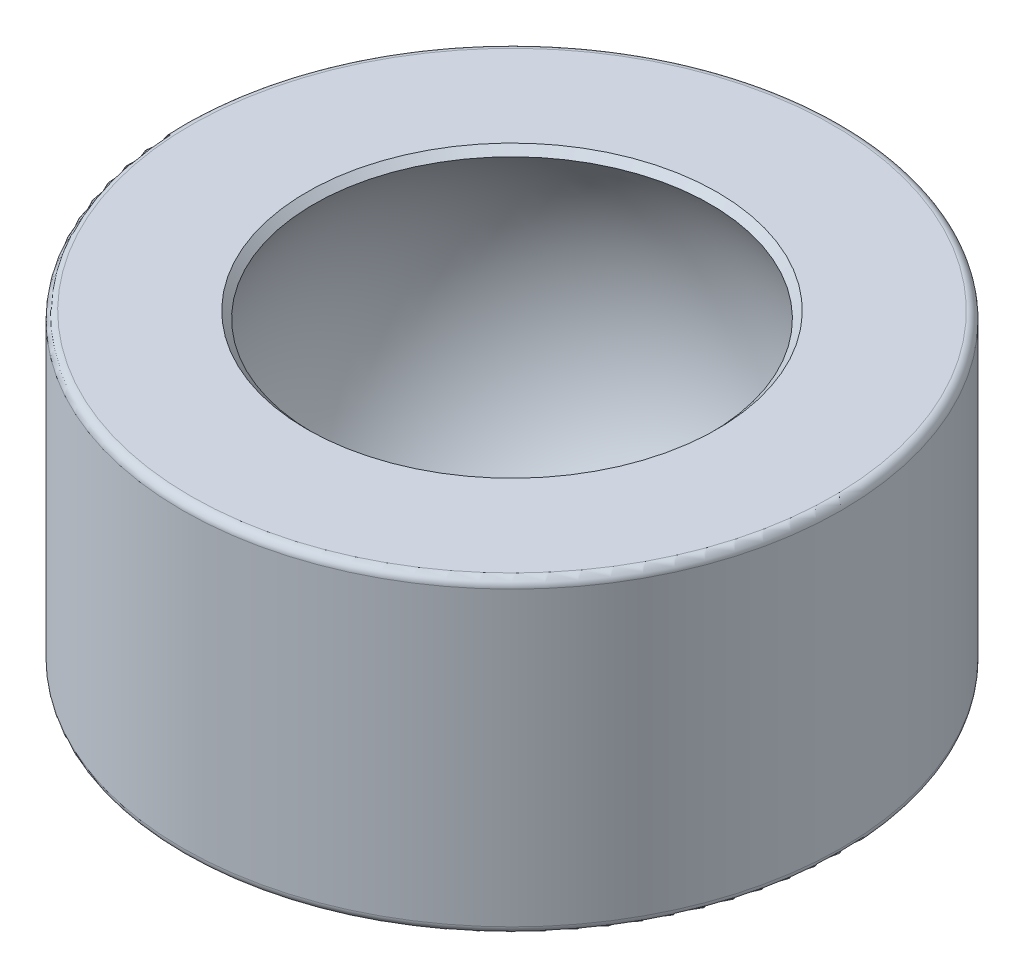
ISO-10303-21;
HEADER;
FILE_DESCRIPTION(('STEP AP214'),'2;1');
FILE_NAME('part.step','',(''),(''),'','','');
FILE_SCHEMA(('AUTOMOTIVE_DESIGN { 1 0 10303 214 1 1 1 1 }'));
ENDSEC;
DATA;
#1=APPLICATION_CONTEXT('core data for automotive mechanical design processes');
#2=APPLICATION_PROTOCOL_DEFINITION('international standard','automotive_design',2000,#1);
#3=PRODUCT_CONTEXT('',#1,'mechanical');
#4=PRODUCT('Part','Part','',(#3));
#5=PRODUCT_RELATED_PRODUCT_CATEGORY('part','',(#4));
#6=PRODUCT_DEFINITION_FORMATION('','',#4);
#7=PRODUCT_DEFINITION_CONTEXT('part definition',#1,'design');
#8=PRODUCT_DEFINITION('design','',#6,#7);
#9=PRODUCT_DEFINITION_SHAPE('','',#8);
#10=(LENGTH_UNIT() NAMED_UNIT(*) SI_UNIT(.MILLI.,.METRE.));
#11=(NAMED_UNIT(*) PLANE_ANGLE_UNIT() SI_UNIT($,.RADIAN.));
#12=(NAMED_UNIT(*) SI_UNIT($,.STERADIAN.) SOLID_ANGLE_UNIT());
#13=UNCERTAINTY_MEASURE_WITH_UNIT(LENGTH_MEASURE(1.E-05),#10,'distance_accuracy_value','');
#14=(GEOMETRIC_REPRESENTATION_CONTEXT(3) GLOBAL_UNCERTAINTY_ASSIGNED_CONTEXT((#13)) GLOBAL_UNIT_ASSIGNED_CONTEXT((#10,
#11,#12)) REPRESENTATION_CONTEXT('',''));
#15=CARTESIAN_POINT('',(0.,0.,0.));
#16=DIRECTION('',(0.,0.,1.));
#17=DIRECTION('',(1.,0.,0.));
#18=AXIS2_PLACEMENT_3D('',#15,#16,#17);
#19=CARTESIAN_POINT('',(0.,-1.875,0.));
#20=DIRECTION('',(0.,1.,0.));
#21=DIRECTION('',(0.,0.,1.));
#22=AXIS2_PLACEMENT_3D('',#19,#20,#21);
#23=CYLINDRICAL_SURFACE('',#22,4.);
#24=CARTESIAN_POINT('',(0.,1.775,0.));
#25=DIRECTION('',(0.,1.,0.));
#26=DIRECTION('',(0.,0.,1.));
#27=AXIS2_PLACEMENT_3D('',#24,#25,#26);
#28=CIRCLE('',#27,4.);
#29=CARTESIAN_POINT('',(0.,1.775,4.));
#30=VERTEX_POINT('',#29);
#31=EDGE_CURVE('E64',#30,#30,#28,.F.);
#32=ORIENTED_EDGE('',*,*,#31,.T.);
#33=EDGE_LOOP('',(#32));
#34=FACE_BOUND('',#33,.T.);
#35=CARTESIAN_POINT('',(0.,-1.775,0.));
#36=DIRECTION('',(0.,1.,0.));
#37=DIRECTION('',(0.,0.,1.));
#38=AXIS2_PLACEMENT_3D('',#35,#36,#37);
#39=CIRCLE('',#38,4.);
#40=CARTESIAN_POINT('',(0.,-1.775,4.));
#41=VERTEX_POINT('',#40);
#42=EDGE_CURVE('E67',#41,#41,#39,.T.);
#43=ORIENTED_EDGE('',*,*,#42,.T.);
#44=EDGE_LOOP('',(#43));
#45=FACE_BOUND('',#44,.T.);
#46=ADVANCED_FACE('F40',(#34,#45),#23,.T.);
#47=CARTESIAN_POINT('',(0.,-1.875,0.));
#48=DIRECTION('',(0.,1.,0.));
#49=DIRECTION('',(0.,0.,1.));
#50=AXIS2_PLACEMENT_3D('',#47,#48,#49);
#51=PLANE('',#50);
#52=CARTESIAN_POINT('',(0.,-1.875,0.));
#53=DIRECTION('',(0.,1.,0.));
#54=DIRECTION('',(0.,0.,1.));
#55=AXIS2_PLACEMENT_3D('',#52,#53,#54);
#56=CIRCLE('',#55,2.44858836354783);
#57=CARTESIAN_POINT('',(0.,-1.875,2.44858836354783));
#58=VERTEX_POINT('',#57);
#59=EDGE_CURVE('E56',#58,#58,#56,.T.);
#60=ORIENTED_EDGE('',*,*,#59,.T.);
#61=EDGE_LOOP('',(#60));
#62=FACE_BOUND('',#61,.T.);
#63=CARTESIAN_POINT('',(0.,-1.875,0.));
#64=DIRECTION('',(0.,1.,0.));
#65=DIRECTION('',(0.,0.,1.));
#66=AXIS2_PLACEMENT_3D('',#63,#64,#65);
#67=CIRCLE('',#66,3.9);
#68=CARTESIAN_POINT('',(0.,-1.875,3.9));
#69=VERTEX_POINT('',#68);
#70=EDGE_CURVE('E61',#69,#69,#67,.F.);
#71=ORIENTED_EDGE('',*,*,#70,.T.);
#72=EDGE_LOOP('',(#71));
#73=FACE_BOUND('',#72,.T.);
#74=ADVANCED_FACE('F93',(#62,#73),#51,.F.);
#75=CARTESIAN_POINT('',(0.,1.875,0.));
#76=DIRECTION('',(0.,1.,0.));
#77=DIRECTION('',(0.,0.,1.));
#78=AXIS2_PLACEMENT_3D('',#75,#76,#77);
#79=PLANE('',#78);
#80=CARTESIAN_POINT('',(0.,1.875,0.));
#81=DIRECTION('',(0.,1.,0.));
#82=DIRECTION('',(0.,0.,1.));
#83=AXIS2_PLACEMENT_3D('',#80,#81,#82);
#84=CIRCLE('',#83,2.4918742493994);
#85=CARTESIAN_POINT('',(0.,1.875,2.4918742493994));
#86=VERTEX_POINT('',#85);
#87=EDGE_CURVE('E10',#86,#86,#84,.F.);
#88=ORIENTED_EDGE('',*,*,#87,.T.);
#89=EDGE_LOOP('',(#88));
#90=FACE_BOUND('',#89,.T.);
#91=CARTESIAN_POINT('',(0.,1.875,0.));
#92=DIRECTION('',(0.,1.,0.));
#93=DIRECTION('',(0.,0.,1.));
#94=AXIS2_PLACEMENT_3D('',#91,#92,#93);
#95=CIRCLE('',#94,3.9);
#96=CARTESIAN_POINT('',(0.,1.875,3.9));
#97=VERTEX_POINT('',#96);
#98=EDGE_CURVE('E70',#97,#97,#95,.T.);
#99=ORIENTED_EDGE('',*,*,#98,.T.);
#100=EDGE_LOOP('',(#99));
#101=FACE_BOUND('',#100,.T.);
#102=ADVANCED_FACE('F74',(#90,#101),#79,.T.);
#103=CARTESIAN_POINT('',(0.,0.,0.));
#104=DIRECTION('',(0.,0.,-1.));
#105=DIRECTION('',(1.,0.,0.));
#106=AXIS2_PLACEMENT_3D('',#103,#104,#105);
#107=SPHERICAL_SURFACE('',#106,3.);
#108=CARTESIAN_POINT('',(0.,0.,0.));
#109=DIRECTION('',(0.,1.,0.));
#110=DIRECTION('',(0.,0.,1.));
#111=AXIS2_PLACEMENT_3D('',#108,#109,#110);
#112=SPHERICAL_SURFACE('',#111,3.);
#113=CARTESIAN_POINT('',(0.,-1.75235006248991,0.));
#114=DIRECTION('',(0.,1.,0.));
#115=DIRECTION('',(0.,0.,1.));
#116=AXIS2_PLACEMENT_3D('',#113,#114,#115);
#117=CIRCLE('',#116,2.43500908796899);
#118=CARTESIAN_POINT('',(0.,-1.75235006248991,2.43500908796899));
#119=VERTEX_POINT('',#118);
#120=EDGE_CURVE('E48',#119,#119,#117,.F.);
#121=ORIENTED_EDGE('',*,*,#120,.T.);
#122=EDGE_LOOP('',(#121));
#123=FACE_BOUND('',#122,.T.);
#124=CARTESIAN_POINT('',(0.,1.79034026704698,0.));
#125=DIRECTION('',(0.,-1.,0.));
#126=DIRECTION('',(0.,0.,-1.));
#127=AXIS2_PLACEMENT_3D('',#124,#125,#126);
#128=CIRCLE('',#127,2.40721451644638);
#129=CARTESIAN_POINT('',(0.,1.79034026704698,2.40721451644638));
#130=VERTEX_POINT('',#129);
#131=EDGE_CURVE('E52',#130,#130,#128,.F.);
#132=ORIENTED_EDGE('',*,*,#131,.T.);
#133=EDGE_LOOP('',(#132));
#134=FACE_BOUND('',#133,.T.);
#135=ADVANCED_FACE('F79',(#123,#134),#112,.F.);
#136=CARTESIAN_POINT('',(0.,1.775,0.));
#137=DIRECTION('',(0.,1.,0.));
#138=DIRECTION('',(0.,0.,1.));
#139=AXIS2_PLACEMENT_3D('',#136,#137,#138);
#140=TOROIDAL_SURFACE('',#139,3.9,0.1);
#141=ORIENTED_EDGE('',*,*,#31,.F.);
#142=EDGE_LOOP('',(#141));
#143=FACE_BOUND('',#142,.T.);
#144=ORIENTED_EDGE('',*,*,#98,.F.);
#145=EDGE_LOOP('',(#144));
#146=FACE_BOUND('',#145,.T.);
#147=ADVANCED_FACE('F76',(#143,#146),#140,.T.);
#148=CARTESIAN_POINT('',(0.,-1.775,0.));
#149=DIRECTION('',(0.,1.,0.));
#150=DIRECTION('',(0.,0.,1.));
#151=AXIS2_PLACEMENT_3D('',#148,#149,#150);
#152=TOROIDAL_SURFACE('',#151,3.9,0.1);
#153=ORIENTED_EDGE('',*,*,#70,.F.);
#154=EDGE_LOOP('',(#153));
#155=FACE_BOUND('',#154,.T.);
#156=ORIENTED_EDGE('',*,*,#42,.F.);
#157=EDGE_LOOP('',(#156));
#158=FACE_BOUND('',#157,.T.);
#159=ADVANCED_FACE('F78',(#155,#158),#152,.T.);
#160=CARTESIAN_POINT('',(0.,-1.875,0.));
#161=DIRECTION('',(0.,-1.,0.));
#162=DIRECTION('',(0.,0.,-1.));
#163=AXIS2_PLACEMENT_3D('',#160,#161,#162);
#164=CONICAL_SURFACE('',#163,2.44858836354783,0.11026663046042);
#165=ORIENTED_EDGE('',*,*,#120,.F.);
#166=EDGE_LOOP('',(#165));
#167=FACE_BOUND('',#166,.T.);
#168=ORIENTED_EDGE('',*,*,#59,.F.);
#169=EDGE_LOOP('',(#168));
#170=FACE_BOUND('',#169,.T.);
#171=ADVANCED_FACE('F86',(#167,#170),#164,.F.);
#172=CARTESIAN_POINT('',(0.,1.79034026704698,0.));
#173=DIRECTION('',(0.,1.,0.));
#174=DIRECTION('',(0.,0.,1.));
#175=AXIS2_PLACEMENT_3D('',#172,#173,#174);
#176=CONICAL_SURFACE('',#175,2.40721451644638,0.785398163397448);
#177=CARTESIAN_POINT('',(0.,1.875,2.4918742493994));
#178=CARTESIAN_POINT('',(0.,1.87411812778174,2.49099237718114));
#179=CARTESIAN_POINT('',(0.,1.87323625556348,2.49011050496288));
#180=CARTESIAN_POINT('',(0.,1.87147251112696,2.48834676052636));
#181=CARTESIAN_POINT('',(0.,1.8705906389087,2.4874648883081));
#182=CARTESIAN_POINT('',(0.,1.86882689447218,2.48570114387158));
#183=CARTESIAN_POINT('',(0.,1.86794502225391,2.48481927165331));
#184=CARTESIAN_POINT('',(0.,1.86618127781739,2.48305552721679));
#185=CARTESIAN_POINT('',(0.,1.86529940559913,2.48217365499853));
#186=CARTESIAN_POINT('',(0.,1.86353566116261,2.48040991056201));
#187=CARTESIAN_POINT('',(0.,1.86265378894435,2.47952803834375));
#188=CARTESIAN_POINT('',(0.,1.86089004450783,2.47776429390723));
#189=CARTESIAN_POINT('',(0.,1.86000817228957,2.47688242168897));
#190=CARTESIAN_POINT('',(0.,1.85824442785305,2.47511867725245));
#191=CARTESIAN_POINT('',(0.,1.85736255563479,2.47423680503419));
#192=CARTESIAN_POINT('',(0.,1.85559881119827,2.47247306059767));
#193=CARTESIAN_POINT('',(0.,1.85471693898,2.47159118837941));
#194=CARTESIAN_POINT('',(0.,1.85295319454348,2.46982744394288));
#195=CARTESIAN_POINT('',(0.,1.85207132232522,2.46894557172462));
#196=CARTESIAN_POINT('',(0.,1.8503075778887,2.4671818272881));
#197=CARTESIAN_POINT('',(0.,1.84942570567044,2.46629995506984));
#198=CARTESIAN_POINT('',(0.,1.84766196123392,2.46453621063332));
#199=CARTESIAN_POINT('',(0.,1.84678008901566,2.46365433841506));
#200=CARTESIAN_POINT('',(0.,1.84501634457914,2.46189059397854));
#201=CARTESIAN_POINT('',(0.,1.84413447236088,2.46100872176028));
#202=CARTESIAN_POINT('',(0.,1.84237072792436,2.45924497732376));
#203=CARTESIAN_POINT('',(0.,1.84148885570609,2.45836310510549));
#204=CARTESIAN_POINT('',(0.,1.83972511126957,2.45659936066897));
#205=CARTESIAN_POINT('',(0.,1.83884323905131,2.45571748845071));
#206=CARTESIAN_POINT('',(0.,1.83707949461479,2.45395374401419));
#207=CARTESIAN_POINT('',(0.,1.83619762239653,2.45307187179593));
#208=CARTESIAN_POINT('',(0.,1.83443387796001,2.45130812735941));
#209=CARTESIAN_POINT('',(0.,1.83355200574175,2.45042625514115));
#210=CARTESIAN_POINT('',(0.,1.83178826130523,2.44866251070463));
#211=CARTESIAN_POINT('',(0.,1.83090638908697,2.44778063848637));
#212=CARTESIAN_POINT('',(0.,1.82914264465045,2.44601689404985));
#213=CARTESIAN_POINT('',(0.,1.82826077243218,2.44513502183159));
#214=CARTESIAN_POINT('',(0.,1.82649702799566,2.44337127739506));
#215=CARTESIAN_POINT('',(0.,1.8256151557774,2.4424894051768));
#216=CARTESIAN_POINT('',(0.,1.82385141134088,2.44072566074028));
#217=CARTESIAN_POINT('',(0.,1.82296953912262,2.43984378852202));
#218=CARTESIAN_POINT('',(0.,1.8212057946861,2.4380800440855));
#219=CARTESIAN_POINT('',(0.,1.82032392246784,2.43719817186724));
#220=CARTESIAN_POINT('',(0.,1.81856017803132,2.43543442743072));
#221=CARTESIAN_POINT('',(0.,1.81767830581306,2.43455255521246));
#222=CARTESIAN_POINT('',(0.,1.81591456137654,2.43278881077594));
#223=CARTESIAN_POINT('',(0.,1.81503268915827,2.43190693855767));
#224=CARTESIAN_POINT('',(0.,1.81326894472175,2.43014319412115));
#225=CARTESIAN_POINT('',(0.,1.81238707250349,2.42926132190289));
#226=CARTESIAN_POINT('',(0.,1.81062332806697,2.42749757746637));
#227=CARTESIAN_POINT('',(0.,1.80974145584871,2.42661570524811));
#228=CARTESIAN_POINT('',(0.,1.80797771141219,2.42485196081159));
#229=CARTESIAN_POINT('',(0.,1.80709583919393,2.42397008859333));
#230=CARTESIAN_POINT('',(0.,1.80533209475741,2.42220634415681));
#231=CARTESIAN_POINT('',(0.,1.80445022253915,2.42132447193855));
#232=CARTESIAN_POINT('',(0.,1.80268647810263,2.41956072750203));
#233=CARTESIAN_POINT('',(0.,1.80180460588436,2.41867885528377));
#234=CARTESIAN_POINT('',(0.,1.80004086144784,2.41691511084724));
#235=CARTESIAN_POINT('',(0.,1.79915898922958,2.41603323862898));
#236=CARTESIAN_POINT('',(0.,1.79739524479306,2.41426949419246));
#237=CARTESIAN_POINT('',(0.,1.7965133725748,2.4133876219742));
#238=CARTESIAN_POINT('',(0.,1.79474962813828,2.41162387753768));
#239=CARTESIAN_POINT('',(0.,1.79386775592002,2.41074200531942));
#240=CARTESIAN_POINT('',(0.,1.7921040114835,2.4089782608829));
#241=CARTESIAN_POINT('',(0.,1.79122213926524,2.40809638866464));
#242=CARTESIAN_POINT('',(0.,1.79034026704698,2.40721451644638));
#243=B_SPLINE_CURVE_WITH_KNOTS('',3,(#177,#178,#179,#180,#181,#182,#183,#184,#185,#186,#187,
#188,#189,#190,#191,#192,#193,#194,#195,#196,#197,#198,#199,#200,#201,#202,#203,#204,#205,#206,
#207,#208,#209,#210,#211,#212,#213,#214,#215,#216,#217,#218,#219,#220,#221,#222,#223,#224,#225,
#226,#227,#228,#229,#230,#231,#232,#233,#234,#235,#236,#237,#238,#239,#240,#241,#242),
.UNSPECIFIED.,.F.,.F.,(4,2,2,2,2,2,2,2,2,2,2,2,2,2,2,2,2,2,2,2,2,2,2,2,2,2,2,2,2,2,2,2,4),(0.,
0.00374146695403291,0.00748293390806566,0.0112244008620984,0.0149658678161315,
0.0187073347701641,0.0224488017241968,0.0261902686782299,0.0299317356322627,0.0336732025862956,
0.0374146695403283,0.0411561364943611,0.0448976034483941,0.0486390704024267,0.0523805373564598,
0.0561220043104926,0.0598634712645253,0.0636049382185582,0.067346405172591,0.0710878721266237,
0.0748293390806568,0.0785708060346894,0.0823122729887221,0.0860537399427552,0.0897952068967879,
0.0935366738508209,0.0972781408048536,0.101019607758886,0.104761074712919,0.108502541666952,
0.112244008620985,0.115985475575018,0.11972694252905),.UNSPECIFIED.);
#244=EDGE_CURVE('BSEAM43',#86,#130,#243,.T.);
#245=ORIENTED_EDGE('',*,*,#87,.F.);
#246=ORIENTED_EDGE('',*,*,#131,.F.);
#247=ORIENTED_EDGE('',*,*,#244,.T.);
#248=ORIENTED_EDGE('',*,*,#244,.F.);
#249=EDGE_LOOP('',(#245,#247,#246,#248));
#250=FACE_BOUND('',#249,.T.);
#251=ADVANCED_FACE('F43',(#250),#176,.F.);
#252=CLOSED_SHELL('',(#46,#74,#102,#135,#147,#159,#171,#251));
#253=MANIFOLD_SOLID_BREP('B2',#252);
#254=ADVANCED_BREP_SHAPE_REPRESENTATION('',(#18,#253),#14);
#255=SHAPE_DEFINITION_REPRESENTATION(#9,#254);
ENDSEC;
END-ISO-10303-21;
